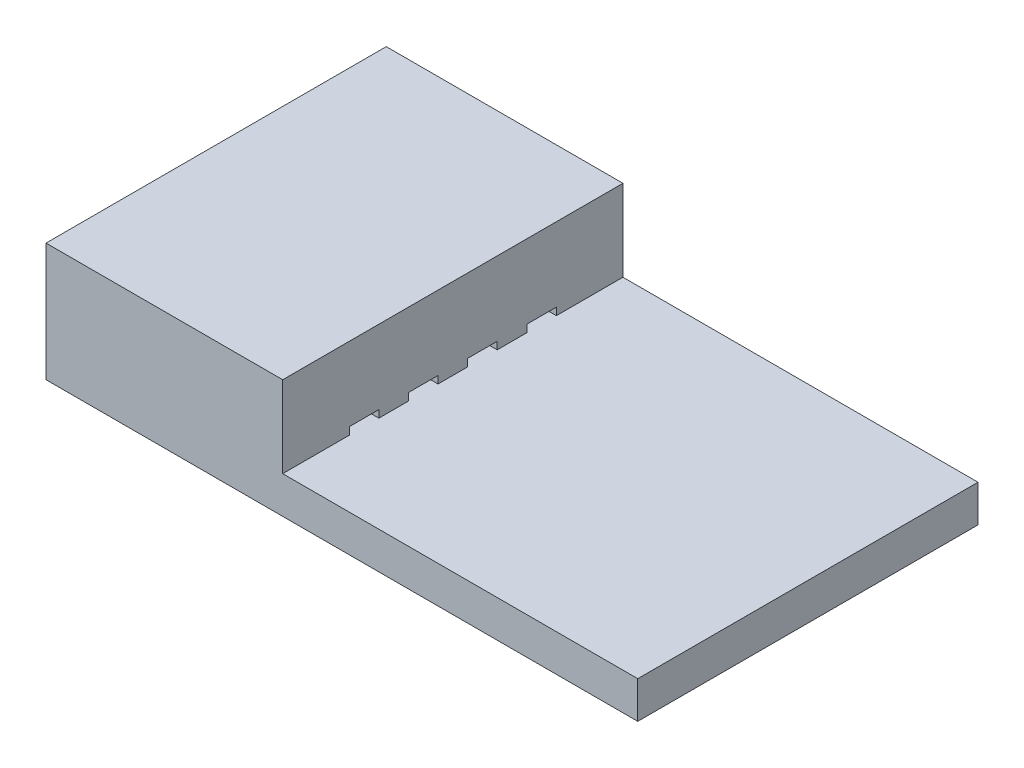
ISO-10303-21;
HEADER;
FILE_DESCRIPTION(('STEP AP214'),'2;1');
FILE_NAME('part.step','',(''),(''),'','','');
FILE_SCHEMA(('AUTOMOTIVE_DESIGN { 1 0 10303 214 1 1 1 1 }'));
ENDSEC;
DATA;
#1=APPLICATION_CONTEXT('core data for automotive mechanical design processes');
#2=APPLICATION_PROTOCOL_DEFINITION('international standard','automotive_design',2000,#1);
#3=PRODUCT_CONTEXT('',#1,'mechanical');
#4=PRODUCT('Part','Part','',(#3));
#5=PRODUCT_RELATED_PRODUCT_CATEGORY('part','',(#4));
#6=PRODUCT_DEFINITION_FORMATION('','',#4);
#7=PRODUCT_DEFINITION_CONTEXT('part definition',#1,'design');
#8=PRODUCT_DEFINITION('design','',#6,#7);
#9=PRODUCT_DEFINITION_SHAPE('','',#8);
#10=(LENGTH_UNIT() NAMED_UNIT(*) SI_UNIT(.MILLI.,.METRE.));
#11=(NAMED_UNIT(*) PLANE_ANGLE_UNIT() SI_UNIT($,.RADIAN.));
#12=(NAMED_UNIT(*) SI_UNIT($,.STERADIAN.) SOLID_ANGLE_UNIT());
#13=UNCERTAINTY_MEASURE_WITH_UNIT(LENGTH_MEASURE(1.E-05),#10,'distance_accuracy_value','');
#14=(GEOMETRIC_REPRESENTATION_CONTEXT(3) GLOBAL_UNCERTAINTY_ASSIGNED_CONTEXT((#13)) GLOBAL_UNIT_ASSIGNED_CONTEXT((#10,
#11,#12)) REPRESENTATION_CONTEXT('',''));
#15=CARTESIAN_POINT('',(0.,0.,0.));
#16=DIRECTION('',(0.,0.,1.));
#17=DIRECTION('',(1.,0.,0.));
#18=AXIS2_PLACEMENT_3D('',#15,#16,#17);
#19=CARTESIAN_POINT('',(-20.,2.,-5.75));
#20=DIRECTION('',(0.,0.,-1.));
#21=DIRECTION('',(-1.,0.,0.));
#22=AXIS2_PLACEMENT_3D('',#19,#20,#21);
#23=PLANE('',#22);
#24=DIRECTION('',(-1.,0.,0.));
#25=VECTOR('',#24,1.);
#26=CARTESIAN_POINT('',(0.,-0.750000000000001,-5.75));
#27=LINE('',#26,#25);
#28=CARTESIAN_POINT('',(0.,-0.750000000000001,-5.75));
#29=VERTEX_POINT('',#28);
#30=CARTESIAN_POINT('',(-12.,-0.750000000000001,-5.75));
#31=VERTEX_POINT('',#30);
#32=EDGE_CURVE('E317',#29,#31,#27,.T.);
#33=ORIENTED_EDGE('',*,*,#32,.F.);
#34=DIRECTION('',(0.,1.,0.));
#35=VECTOR('',#34,1.);
#36=CARTESIAN_POINT('',(0.,2.,-5.75));
#37=LINE('',#36,#35);
#38=CARTESIAN_POINT('',(0.,-2.,-5.75));
#39=VERTEX_POINT('',#38);
#40=EDGE_CURVE('E323',#39,#29,#37,.T.);
#41=ORIENTED_EDGE('',*,*,#40,.F.);
#42=DIRECTION('',(1.,0.,0.));
#43=VECTOR('',#42,1.);
#44=CARTESIAN_POINT('',(-20.,-2.,-5.75));
#45=LINE('',#44,#43);
#46=CARTESIAN_POINT('',(-20.,-2.,-5.75));
#47=VERTEX_POINT('',#46);
#48=EDGE_CURVE('E12',#47,#39,#45,.T.);
#49=ORIENTED_EDGE('',*,*,#48,.F.);
#50=DIRECTION('',(0.,1.,0.));
#51=VECTOR('',#50,1.);
#52=CARTESIAN_POINT('',(-20.,2.,-5.75));
#53=LINE('',#52,#51);
#54=CARTESIAN_POINT('',(-20.,2.,-5.75));
#55=VERTEX_POINT('',#54);
#56=EDGE_CURVE('E334',#47,#55,#53,.T.);
#57=ORIENTED_EDGE('',*,*,#56,.T.);
#58=DIRECTION('',(1.,0.,0.));
#59=VECTOR('',#58,1.);
#60=CARTESIAN_POINT('',(-20.,2.,-5.75));
#61=LINE('',#60,#59);
#62=CARTESIAN_POINT('',(-12.,2.,-5.75));
#63=VERTEX_POINT('',#62);
#64=EDGE_CURVE('E45',#55,#63,#61,.T.);
#65=ORIENTED_EDGE('',*,*,#64,.T.);
#66=DIRECTION('',(0.,1.,0.));
#67=VECTOR('',#66,1.);
#68=CARTESIAN_POINT('',(-12.,-18.6207701385947,-5.75));
#69=LINE('',#68,#67);
#70=EDGE_CURVE('E320',#31,#63,#69,.T.);
#71=ORIENTED_EDGE('',*,*,#70,.F.);
#72=EDGE_LOOP('',(#33,#41,#49,#57,#65,#71));
#73=FACE_BOUND('',#72,.T.);
#74=ADVANCED_FACE('F42',(#73),#23,.T.);
#75=CARTESIAN_POINT('',(-20.,-2.,5.75));
#76=DIRECTION('',(0.,-1.,0.));
#77=DIRECTION('',(0.,0.,-1.));
#78=AXIS2_PLACEMENT_3D('',#75,#76,#77);
#79=PLANE('',#78);
#80=DIRECTION('',(0.,0.,-1.));
#81=VECTOR('',#80,1.);
#82=CARTESIAN_POINT('',(0.,-2.,5.75));
#83=LINE('',#82,#81);
#84=CARTESIAN_POINT('',(0.,-2.,5.75));
#85=VERTEX_POINT('',#84);
#86=EDGE_CURVE('E338',#85,#39,#83,.T.);
#87=ORIENTED_EDGE('',*,*,#86,.F.);
#88=DIRECTION('',(1.,0.,0.));
#89=VECTOR('',#88,1.);
#90=CARTESIAN_POINT('',(-20.,-2.,5.75));
#91=LINE('',#90,#89);
#92=CARTESIAN_POINT('',(-20.,-2.,5.75));
#93=VERTEX_POINT('',#92);
#94=EDGE_CURVE('E50',#93,#85,#91,.T.);
#95=ORIENTED_EDGE('',*,*,#94,.F.);
#96=DIRECTION('',(0.,0.,-1.));
#97=VECTOR('',#96,1.);
#98=CARTESIAN_POINT('',(-20.,-2.,5.75));
#99=LINE('',#98,#97);
#100=EDGE_CURVE('E344',#93,#47,#99,.T.);
#101=ORIENTED_EDGE('',*,*,#100,.T.);
#102=ORIENTED_EDGE('',*,*,#48,.T.);
#103=EDGE_LOOP('',(#87,#95,#101,#102));
#104=FACE_BOUND('',#103,.T.);
#105=ADVANCED_FACE('F385',(#104),#79,.T.);
#106=CARTESIAN_POINT('',(-20.,2.,5.75));
#107=DIRECTION('',(0.,0.,1.));
#108=DIRECTION('',(1.,0.,0.));
#109=AXIS2_PLACEMENT_3D('',#106,#107,#108);
#110=PLANE('',#109);
#111=DIRECTION('',(1.,0.,0.));
#112=VECTOR('',#111,1.);
#113=CARTESIAN_POINT('',(0.,-0.750000000000001,5.75));
#114=LINE('',#113,#112);
#115=CARTESIAN_POINT('',(-12.,-0.750000000000001,5.75));
#116=VERTEX_POINT('',#115);
#117=CARTESIAN_POINT('',(0.,-0.750000000000001,5.75));
#118=VERTEX_POINT('',#117);
#119=EDGE_CURVE('E324',#116,#118,#114,.T.);
#120=ORIENTED_EDGE('',*,*,#119,.F.);
#121=DIRECTION('',(0.,1.,0.));
#122=VECTOR('',#121,1.);
#123=CARTESIAN_POINT('',(-12.,-18.6207701385947,5.75));
#124=LINE('',#123,#122);
#125=CARTESIAN_POINT('',(-12.,2.,5.75));
#126=VERTEX_POINT('',#125);
#127=EDGE_CURVE('E326',#116,#126,#124,.T.);
#128=ORIENTED_EDGE('',*,*,#127,.T.);
#129=DIRECTION('',(1.,0.,0.));
#130=VECTOR('',#129,1.);
#131=CARTESIAN_POINT('',(-20.,2.,5.75));
#132=LINE('',#131,#130);
#133=CARTESIAN_POINT('',(-20.,2.,5.75));
#134=VERTEX_POINT('',#133);
#135=EDGE_CURVE('E354',#134,#126,#132,.T.);
#136=ORIENTED_EDGE('',*,*,#135,.F.);
#137=DIRECTION('',(0.,-1.,0.));
#138=VECTOR('',#137,1.);
#139=CARTESIAN_POINT('',(-20.,2.,5.75));
#140=LINE('',#139,#138);
#141=EDGE_CURVE('E341',#134,#93,#140,.T.);
#142=ORIENTED_EDGE('',*,*,#141,.T.);
#143=ORIENTED_EDGE('',*,*,#94,.T.);
#144=DIRECTION('',(0.,-1.,0.));
#145=VECTOR('',#144,1.);
#146=CARTESIAN_POINT('',(0.,2.,5.75));
#147=LINE('',#146,#145);
#148=EDGE_CURVE('E349',#118,#85,#147,.T.);
#149=ORIENTED_EDGE('',*,*,#148,.F.);
#150=EDGE_LOOP('',(#120,#128,#136,#142,#143,#149));
#151=FACE_BOUND('',#150,.T.);
#152=ADVANCED_FACE('F370',(#151),#110,.T.);
#153=CARTESIAN_POINT('',(-20.,2.,5.75));
#154=DIRECTION('',(0.,1.,0.));
#155=DIRECTION('',(0.,0.,1.));
#156=AXIS2_PLACEMENT_3D('',#153,#154,#155);
#157=PLANE('',#156);
#158=DIRECTION('',(0.,0.,1.));
#159=VECTOR('',#158,1.);
#160=CARTESIAN_POINT('',(-12.,2.,5.75));
#161=LINE('',#160,#159);
#162=EDGE_CURVE('E308',#63,#126,#161,.T.);
#163=ORIENTED_EDGE('',*,*,#162,.F.);
#164=ORIENTED_EDGE('',*,*,#64,.F.);
#165=DIRECTION('',(0.,0.,1.));
#166=VECTOR('',#165,1.);
#167=CARTESIAN_POINT('',(-20.,2.,5.75));
#168=LINE('',#167,#166);
#169=EDGE_CURVE('E337',#55,#134,#168,.T.);
#170=ORIENTED_EDGE('',*,*,#169,.T.);
#171=ORIENTED_EDGE('',*,*,#135,.T.);
#172=EDGE_LOOP('',(#163,#164,#170,#171));
#173=FACE_BOUND('',#172,.T.);
#174=ADVANCED_FACE('F364',(#173),#157,.T.);
#175=CARTESIAN_POINT('',(-20.,-2.,-5.75));
#176=DIRECTION('',(1.,0.,0.));
#177=DIRECTION('',(0.,0.,-1.));
#178=AXIS2_PLACEMENT_3D('',#175,#176,#177);
#179=PLANE('',#178);
#180=DIRECTION('',(0.,0.,1.));
#181=VECTOR('',#180,1.);
#182=CARTESIAN_POINT('',(-20.,-0.500000000000001,-2.5));
#183=LINE('',#182,#181);
#184=CARTESIAN_POINT('',(-20.,-0.500000000000001,-3.5));
#185=VERTEX_POINT('',#184);
#186=CARTESIAN_POINT('',(-20.,-0.500000000000001,-2.5));
#187=VERTEX_POINT('',#186);
#188=EDGE_CURVE('E198',#185,#187,#183,.T.);
#189=ORIENTED_EDGE('',*,*,#188,.T.);
#190=DIRECTION('',(0.,-1.,0.));
#191=VECTOR('',#190,1.);
#192=CARTESIAN_POINT('',(-20.,-0.750000000000001,-2.5));
#193=LINE('',#192,#191);
#194=CARTESIAN_POINT('',(-20.,-0.750000000000001,-2.5));
#195=VERTEX_POINT('',#194);
#196=EDGE_CURVE('E193',#187,#195,#193,.T.);
#197=ORIENTED_EDGE('',*,*,#196,.T.);
#198=DIRECTION('',(0.,0.,-1.));
#199=VECTOR('',#198,1.);
#200=CARTESIAN_POINT('',(-20.,-0.750000000000001,-2.5));
#201=LINE('',#200,#199);
#202=CARTESIAN_POINT('',(-20.,-0.750000000000001,-3.5));
#203=VERTEX_POINT('',#202);
#204=EDGE_CURVE('E201',#195,#203,#201,.T.);
#205=ORIENTED_EDGE('',*,*,#204,.T.);
#206=DIRECTION('',(0.,1.,0.));
#207=VECTOR('',#206,1.);
#208=CARTESIAN_POINT('',(-20.,-0.750000000000001,-3.5));
#209=LINE('',#208,#207);
#210=EDGE_CURVE('E58',#203,#185,#209,.T.);
#211=ORIENTED_EDGE('',*,*,#210,.T.);
#212=EDGE_LOOP('',(#189,#197,#205,#211));
#213=FACE_BOUND('',#212,.T.);
#214=DIRECTION('',(0.,0.,1.));
#215=VECTOR('',#214,1.);
#216=CARTESIAN_POINT('',(-20.,-0.500000000000001,-0.5));
#217=LINE('',#216,#215);
#218=CARTESIAN_POINT('',(-20.,-0.500000000000001,-1.5));
#219=VERTEX_POINT('',#218);
#220=CARTESIAN_POINT('',(-20.,-0.500000000000001,-0.5));
#221=VERTEX_POINT('',#220);
#222=EDGE_CURVE('E236',#219,#221,#217,.T.);
#223=ORIENTED_EDGE('',*,*,#222,.T.);
#224=DIRECTION('',(0.,-1.,0.));
#225=VECTOR('',#224,1.);
#226=CARTESIAN_POINT('',(-20.,-0.750000000000001,-0.5));
#227=LINE('',#226,#225);
#228=CARTESIAN_POINT('',(-20.,-0.750000000000001,-0.5));
#229=VERTEX_POINT('',#228);
#230=EDGE_CURVE('E226',#221,#229,#227,.T.);
#231=ORIENTED_EDGE('',*,*,#230,.T.);
#232=DIRECTION('',(0.,0.,-1.));
#233=VECTOR('',#232,1.);
#234=CARTESIAN_POINT('',(-20.,-0.750000000000001,-0.5));
#235=LINE('',#234,#233);
#236=CARTESIAN_POINT('',(-20.,-0.750000000000001,-1.5));
#237=VERTEX_POINT('',#236);
#238=EDGE_CURVE('E229',#229,#237,#235,.T.);
#239=ORIENTED_EDGE('',*,*,#238,.T.);
#240=DIRECTION('',(0.,1.,0.));
#241=VECTOR('',#240,1.);
#242=CARTESIAN_POINT('',(-20.,-0.750000000000001,-1.5));
#243=LINE('',#242,#241);
#244=EDGE_CURVE('E233',#237,#219,#243,.T.);
#245=ORIENTED_EDGE('',*,*,#244,.T.);
#246=EDGE_LOOP('',(#223,#231,#239,#245));
#247=FACE_BOUND('',#246,.T.);
#248=DIRECTION('',(0.,0.,1.));
#249=VECTOR('',#248,1.);
#250=CARTESIAN_POINT('',(-20.,-0.5,1.5));
#251=LINE('',#250,#249);
#252=CARTESIAN_POINT('',(-20.,-0.5,0.5));
#253=VERTEX_POINT('',#252);
#254=CARTESIAN_POINT('',(-20.,-0.5,1.5));
#255=VERTEX_POINT('',#254);
#256=EDGE_CURVE('E266',#253,#255,#251,.T.);
#257=ORIENTED_EDGE('',*,*,#256,.T.);
#258=DIRECTION('',(0.,-1.,0.));
#259=VECTOR('',#258,1.);
#260=CARTESIAN_POINT('',(-20.,-0.75,1.5));
#261=LINE('',#260,#259);
#262=CARTESIAN_POINT('',(-20.,-0.75,1.5));
#263=VERTEX_POINT('',#262);
#264=EDGE_CURVE('E256',#255,#263,#261,.T.);
#265=ORIENTED_EDGE('',*,*,#264,.T.);
#266=DIRECTION('',(0.,0.,-1.));
#267=VECTOR('',#266,1.);
#268=CARTESIAN_POINT('',(-20.,-0.75,1.5));
#269=LINE('',#268,#267);
#270=CARTESIAN_POINT('',(-20.,-0.75,0.5));
#271=VERTEX_POINT('',#270);
#272=EDGE_CURVE('E259',#263,#271,#269,.T.);
#273=ORIENTED_EDGE('',*,*,#272,.T.);
#274=DIRECTION('',(0.,1.,0.));
#275=VECTOR('',#274,1.);
#276=CARTESIAN_POINT('',(-20.,-0.75,0.5));
#277=LINE('',#276,#275);
#278=EDGE_CURVE('E263',#271,#253,#277,.T.);
#279=ORIENTED_EDGE('',*,*,#278,.T.);
#280=EDGE_LOOP('',(#257,#265,#273,#279));
#281=FACE_BOUND('',#280,.T.);
#282=DIRECTION('',(0.,0.,1.));
#283=VECTOR('',#282,1.);
#284=CARTESIAN_POINT('',(-20.,-0.5,3.5));
#285=LINE('',#284,#283);
#286=CARTESIAN_POINT('',(-20.,-0.5,2.5));
#287=VERTEX_POINT('',#286);
#288=CARTESIAN_POINT('',(-20.,-0.5,3.5));
#289=VERTEX_POINT('',#288);
#290=EDGE_CURVE('E296',#287,#289,#285,.T.);
#291=ORIENTED_EDGE('',*,*,#290,.T.);
#292=DIRECTION('',(0.,-1.,0.));
#293=VECTOR('',#292,1.);
#294=CARTESIAN_POINT('',(-20.,-0.75,3.5));
#295=LINE('',#294,#293);
#296=CARTESIAN_POINT('',(-20.,-0.75,3.5));
#297=VERTEX_POINT('',#296);
#298=EDGE_CURVE('E286',#289,#297,#295,.T.);
#299=ORIENTED_EDGE('',*,*,#298,.T.);
#300=DIRECTION('',(0.,0.,-1.));
#301=VECTOR('',#300,1.);
#302=CARTESIAN_POINT('',(-20.,-0.75,3.5));
#303=LINE('',#302,#301);
#304=CARTESIAN_POINT('',(-20.,-0.75,2.5));
#305=VERTEX_POINT('',#304);
#306=EDGE_CURVE('E289',#297,#305,#303,.T.);
#307=ORIENTED_EDGE('',*,*,#306,.T.);
#308=DIRECTION('',(0.,1.,0.));
#309=VECTOR('',#308,1.);
#310=CARTESIAN_POINT('',(-20.,-0.75,2.5));
#311=LINE('',#310,#309);
#312=EDGE_CURVE('E293',#305,#287,#311,.T.);
#313=ORIENTED_EDGE('',*,*,#312,.T.);
#314=EDGE_LOOP('',(#291,#299,#307,#313));
#315=FACE_BOUND('',#314,.T.);
#316=ORIENTED_EDGE('',*,*,#56,.F.);
#317=ORIENTED_EDGE('',*,*,#100,.F.);
#318=ORIENTED_EDGE('',*,*,#141,.F.);
#319=ORIENTED_EDGE('',*,*,#169,.F.);
#320=EDGE_LOOP('',(#316,#317,#318,#319));
#321=FACE_BOUND('',#320,.T.);
#322=ADVANCED_FACE('F206',(#213,#247,#281,#315,#321),#179,.F.);
#323=CARTESIAN_POINT('',(0.,-2.,-5.75));
#324=DIRECTION('',(1.,0.,0.));
#325=DIRECTION('',(0.,0.,-1.));
#326=AXIS2_PLACEMENT_3D('',#323,#324,#325);
#327=PLANE('',#326);
#328=DIRECTION('',(0.,0.,-1.));
#329=VECTOR('',#328,1.);
#330=CARTESIAN_POINT('',(0.,-0.750000000000001,5.75));
#331=LINE('',#330,#329);
#332=EDGE_CURVE('E321',#118,#29,#331,.T.);
#333=ORIENTED_EDGE('',*,*,#332,.F.);
#334=ORIENTED_EDGE('',*,*,#148,.T.);
#335=ORIENTED_EDGE('',*,*,#86,.T.);
#336=ORIENTED_EDGE('',*,*,#40,.T.);
#337=EDGE_LOOP('',(#333,#334,#335,#336));
#338=FACE_BOUND('',#337,.T.);
#339=ADVANCED_FACE('F383',(#338),#327,.T.);
#340=CARTESIAN_POINT('',(-20.,-0.75,5.75));
#341=DIRECTION('',(0.,-1.,0.));
#342=DIRECTION('',(0.,0.,-1.));
#343=AXIS2_PLACEMENT_3D('',#340,#341,#342);
#344=PLANE('',#343);
#345=ORIENTED_EDGE('',*,*,#332,.T.);
#346=ORIENTED_EDGE('',*,*,#32,.T.);
#347=DIRECTION('',(0.,0.,1.));
#348=VECTOR('',#347,1.);
#349=CARTESIAN_POINT('',(-12.,-0.750000000000001,5.75));
#350=LINE('',#349,#348);
#351=CARTESIAN_POINT('',(-12.,-0.750000000000001,-3.5));
#352=VERTEX_POINT('',#351);
#353=EDGE_CURVE('E327',#31,#352,#350,.T.);
#354=ORIENTED_EDGE('',*,*,#353,.T.);
#355=DIRECTION('',(1.,0.,0.));
#356=VECTOR('',#355,1.);
#357=CARTESIAN_POINT('',(-20.,-0.750000000000001,-3.5));
#358=LINE('',#357,#356);
#359=EDGE_CURVE('E197',#203,#352,#358,.T.);
#360=ORIENTED_EDGE('',*,*,#359,.F.);
#361=ORIENTED_EDGE('',*,*,#204,.F.);
#362=DIRECTION('',(1.,0.,0.));
#363=VECTOR('',#362,1.);
#364=CARTESIAN_POINT('',(-20.,-0.750000000000001,-2.5));
#365=LINE('',#364,#363);
#366=CARTESIAN_POINT('',(-12.,-0.750000000000001,-2.5));
#367=VERTEX_POINT('',#366);
#368=EDGE_CURVE('E189',#195,#367,#365,.T.);
#369=ORIENTED_EDGE('',*,*,#368,.T.);
#370=CARTESIAN_POINT('',(-12.,-0.750000000000001,-1.5));
#371=VERTEX_POINT('',#370);
#372=EDGE_CURVE('E329',#367,#371,#350,.T.);
#373=ORIENTED_EDGE('',*,*,#372,.T.);
#374=DIRECTION('',(1.,0.,0.));
#375=VECTOR('',#374,1.);
#376=CARTESIAN_POINT('',(-20.,-0.750000000000001,-1.5));
#377=LINE('',#376,#375);
#378=EDGE_CURVE('E251',#237,#371,#377,.T.);
#379=ORIENTED_EDGE('',*,*,#378,.F.);
#380=ORIENTED_EDGE('',*,*,#238,.F.);
#381=DIRECTION('',(1.,0.,0.));
#382=VECTOR('',#381,1.);
#383=CARTESIAN_POINT('',(-20.,-0.750000000000001,-0.5));
#384=LINE('',#383,#382);
#385=CARTESIAN_POINT('',(-12.,-0.750000000000001,-0.5));
#386=VERTEX_POINT('',#385);
#387=EDGE_CURVE('E239',#229,#386,#384,.T.);
#388=ORIENTED_EDGE('',*,*,#387,.T.);
#389=CARTESIAN_POINT('',(-12.,-0.75,0.5));
#390=VERTEX_POINT('',#389);
#391=EDGE_CURVE('E456',#386,#390,#350,.T.);
#392=ORIENTED_EDGE('',*,*,#391,.T.);
#393=DIRECTION('',(1.,0.,0.));
#394=VECTOR('',#393,1.);
#395=CARTESIAN_POINT('',(-20.,-0.75,0.5));
#396=LINE('',#395,#394);
#397=EDGE_CURVE('E281',#271,#390,#396,.T.);
#398=ORIENTED_EDGE('',*,*,#397,.F.);
#399=ORIENTED_EDGE('',*,*,#272,.F.);
#400=DIRECTION('',(1.,0.,0.));
#401=VECTOR('',#400,1.);
#402=CARTESIAN_POINT('',(-20.,-0.75,1.5));
#403=LINE('',#402,#401);
#404=CARTESIAN_POINT('',(-12.,-0.750000000000001,1.5));
#405=VERTEX_POINT('',#404);
#406=EDGE_CURVE('E269',#263,#405,#403,.T.);
#407=ORIENTED_EDGE('',*,*,#406,.T.);
#408=CARTESIAN_POINT('',(-12.,-0.75,2.5));
#409=VERTEX_POINT('',#408);
#410=EDGE_CURVE('E457',#405,#409,#350,.T.);
#411=ORIENTED_EDGE('',*,*,#410,.T.);
#412=DIRECTION('',(1.,0.,0.));
#413=VECTOR('',#412,1.);
#414=CARTESIAN_POINT('',(-20.,-0.75,2.5));
#415=LINE('',#414,#413);
#416=EDGE_CURVE('E311',#305,#409,#415,.T.);
#417=ORIENTED_EDGE('',*,*,#416,.F.);
#418=ORIENTED_EDGE('',*,*,#306,.F.);
#419=DIRECTION('',(1.,0.,0.));
#420=VECTOR('',#419,1.);
#421=CARTESIAN_POINT('',(-20.,-0.75,3.5));
#422=LINE('',#421,#420);
#423=CARTESIAN_POINT('',(-12.,-0.750000000000001,3.5));
#424=VERTEX_POINT('',#423);
#425=EDGE_CURVE('E299',#297,#424,#422,.T.);
#426=ORIENTED_EDGE('',*,*,#425,.T.);
#427=EDGE_CURVE('E330',#424,#116,#350,.T.);
#428=ORIENTED_EDGE('',*,*,#427,.T.);
#429=ORIENTED_EDGE('',*,*,#119,.T.);
#430=EDGE_LOOP('',(#345,#346,#354,#360,#361,#369,#373,#379,#380,#388,#392,#398,#399,#407,#411,
#417,#418,#426,#428,#429));
#431=FACE_BOUND('',#430,.T.);
#432=ADVANCED_FACE('F202',(#431),#344,.F.);
#433=CARTESIAN_POINT('',(-12.,-18.6207701385947,5.75));
#434=DIRECTION('',(-1.,0.,0.));
#435=DIRECTION('',(0.,0.,1.));
#436=AXIS2_PLACEMENT_3D('',#433,#434,#435);
#437=PLANE('',#436);
#438=ORIENTED_EDGE('',*,*,#372,.F.);
#439=DIRECTION('',(0.,-1.,0.));
#440=VECTOR('',#439,1.);
#441=CARTESIAN_POINT('',(-12.,-0.750000000000001,-2.5));
#442=LINE('',#441,#440);
#443=CARTESIAN_POINT('',(-12.,-0.500000000000001,-2.5));
#444=VERTEX_POINT('',#443);
#445=EDGE_CURVE('E66',#444,#367,#442,.T.);
#446=ORIENTED_EDGE('',*,*,#445,.F.);
#447=DIRECTION('',(0.,0.,1.));
#448=VECTOR('',#447,1.);
#449=CARTESIAN_POINT('',(-12.,-0.500000000000001,-2.5));
#450=LINE('',#449,#448);
#451=CARTESIAN_POINT('',(-12.,-0.500000000000001,-3.5));
#452=VERTEX_POINT('',#451);
#453=EDGE_CURVE('E209',#452,#444,#450,.T.);
#454=ORIENTED_EDGE('',*,*,#453,.F.);
#455=DIRECTION('',(0.,1.,0.));
#456=VECTOR('',#455,1.);
#457=CARTESIAN_POINT('',(-12.,-0.750000000000001,-3.5));
#458=LINE('',#457,#456);
#459=EDGE_CURVE('E212',#352,#452,#458,.T.);
#460=ORIENTED_EDGE('',*,*,#459,.F.);
#461=ORIENTED_EDGE('',*,*,#353,.F.);
#462=ORIENTED_EDGE('',*,*,#70,.T.);
#463=ORIENTED_EDGE('',*,*,#162,.T.);
#464=ORIENTED_EDGE('',*,*,#127,.F.);
#465=ORIENTED_EDGE('',*,*,#427,.F.);
#466=DIRECTION('',(0.,-1.,0.));
#467=VECTOR('',#466,1.);
#468=CARTESIAN_POINT('',(-12.,-0.75,3.5));
#469=LINE('',#468,#467);
#470=CARTESIAN_POINT('',(-12.,-0.5,3.5));
#471=VERTEX_POINT('',#470);
#472=EDGE_CURVE('E278',#471,#424,#469,.T.);
#473=ORIENTED_EDGE('',*,*,#472,.F.);
#474=DIRECTION('',(0.,0.,1.));
#475=VECTOR('',#474,1.);
#476=CARTESIAN_POINT('',(-12.,-0.5,3.5));
#477=LINE('',#476,#475);
#478=CARTESIAN_POINT('',(-12.,-0.5,2.5));
#479=VERTEX_POINT('',#478);
#480=EDGE_CURVE('E290',#479,#471,#477,.T.);
#481=ORIENTED_EDGE('',*,*,#480,.F.);
#482=DIRECTION('',(0.,1.,0.));
#483=VECTOR('',#482,1.);
#484=CARTESIAN_POINT('',(-12.,-0.75,2.5));
#485=LINE('',#484,#483);
#486=EDGE_CURVE('E301',#409,#479,#485,.T.);
#487=ORIENTED_EDGE('',*,*,#486,.F.);
#488=ORIENTED_EDGE('',*,*,#410,.F.);
#489=DIRECTION('',(0.,-1.,0.));
#490=VECTOR('',#489,1.);
#491=CARTESIAN_POINT('',(-12.,-0.75,1.5));
#492=LINE('',#491,#490);
#493=CARTESIAN_POINT('',(-12.,-0.5,1.5));
#494=VERTEX_POINT('',#493);
#495=EDGE_CURVE('E248',#494,#405,#492,.T.);
#496=ORIENTED_EDGE('',*,*,#495,.F.);
#497=DIRECTION('',(0.,0.,1.));
#498=VECTOR('',#497,1.);
#499=CARTESIAN_POINT('',(-12.,-0.5,1.5));
#500=LINE('',#499,#498);
#501=CARTESIAN_POINT('',(-12.,-0.5,0.5));
#502=VERTEX_POINT('',#501);
#503=EDGE_CURVE('E260',#502,#494,#500,.T.);
#504=ORIENTED_EDGE('',*,*,#503,.F.);
#505=DIRECTION('',(0.,1.,0.));
#506=VECTOR('',#505,1.);
#507=CARTESIAN_POINT('',(-12.,-0.75,0.5));
#508=LINE('',#507,#506);
#509=EDGE_CURVE('E271',#390,#502,#508,.T.);
#510=ORIENTED_EDGE('',*,*,#509,.F.);
#511=ORIENTED_EDGE('',*,*,#391,.F.);
#512=DIRECTION('',(0.,-1.,0.));
#513=VECTOR('',#512,1.);
#514=CARTESIAN_POINT('',(-12.,-0.750000000000001,-0.5));
#515=LINE('',#514,#513);
#516=CARTESIAN_POINT('',(-12.,-0.500000000000001,-0.5));
#517=VERTEX_POINT('',#516);
#518=EDGE_CURVE('E222',#517,#386,#515,.T.);
#519=ORIENTED_EDGE('',*,*,#518,.F.);
#520=DIRECTION('',(0.,0.,1.));
#521=VECTOR('',#520,1.);
#522=CARTESIAN_POINT('',(-12.,-0.500000000000001,-0.5));
#523=LINE('',#522,#521);
#524=CARTESIAN_POINT('',(-12.,-0.500000000000001,-1.5));
#525=VERTEX_POINT('',#524);
#526=EDGE_CURVE('E230',#525,#517,#523,.T.);
#527=ORIENTED_EDGE('',*,*,#526,.F.);
#528=DIRECTION('',(0.,1.,0.));
#529=VECTOR('',#528,1.);
#530=CARTESIAN_POINT('',(-12.,-0.750000000000001,-1.5));
#531=LINE('',#530,#529);
#532=EDGE_CURVE('E241',#371,#525,#531,.T.);
#533=ORIENTED_EDGE('',*,*,#532,.F.);
#534=EDGE_LOOP('',(#438,#446,#454,#460,#461,#462,#463,#464,#465,#473,#481,#487,#488,#496,#504,
#510,#511,#519,#527,#533));
#535=FACE_BOUND('',#534,.T.);
#536=ADVANCED_FACE('F376',(#535),#437,.F.);
#537=CARTESIAN_POINT('',(-20.,-0.75,3.5));
#538=DIRECTION('',(0.,0.,1.));
#539=DIRECTION('',(0.,-1.,0.));
#540=AXIS2_PLACEMENT_3D('',#537,#538,#539);
#541=PLANE('',#540);
#542=ORIENTED_EDGE('',*,*,#472,.T.);
#543=ORIENTED_EDGE('',*,*,#425,.F.);
#544=ORIENTED_EDGE('',*,*,#298,.F.);
#545=DIRECTION('',(1.,0.,0.));
#546=VECTOR('',#545,1.);
#547=CARTESIAN_POINT('',(-20.,-0.5,3.5));
#548=LINE('',#547,#546);
#549=EDGE_CURVE('E306',#289,#471,#548,.T.);
#550=ORIENTED_EDGE('',*,*,#549,.T.);
#551=EDGE_LOOP('',(#542,#543,#544,#550));
#552=FACE_BOUND('',#551,.T.);
#553=ADVANCED_FACE('F407',(#552),#541,.F.);
#554=CARTESIAN_POINT('',(-20.,-0.5,3.5));
#555=DIRECTION('',(0.,1.,0.));
#556=DIRECTION('',(0.,0.,1.));
#557=AXIS2_PLACEMENT_3D('',#554,#555,#556);
#558=PLANE('',#557);
#559=ORIENTED_EDGE('',*,*,#480,.T.);
#560=ORIENTED_EDGE('',*,*,#549,.F.);
#561=ORIENTED_EDGE('',*,*,#290,.F.);
#562=DIRECTION('',(1.,0.,0.));
#563=VECTOR('',#562,1.);
#564=CARTESIAN_POINT('',(-20.,-0.5,2.5));
#565=LINE('',#564,#563);
#566=EDGE_CURVE('E309',#287,#479,#565,.T.);
#567=ORIENTED_EDGE('',*,*,#566,.T.);
#568=EDGE_LOOP('',(#559,#560,#561,#567));
#569=FACE_BOUND('',#568,.T.);
#570=ADVANCED_FACE('F410',(#569),#558,.F.);
#571=CARTESIAN_POINT('',(-20.,-0.75,2.5));
#572=DIRECTION('',(0.,0.,-1.));
#573=DIRECTION('',(0.,1.,0.));
#574=AXIS2_PLACEMENT_3D('',#571,#572,#573);
#575=PLANE('',#574);
#576=ORIENTED_EDGE('',*,*,#486,.T.);
#577=ORIENTED_EDGE('',*,*,#566,.F.);
#578=ORIENTED_EDGE('',*,*,#312,.F.);
#579=ORIENTED_EDGE('',*,*,#416,.T.);
#580=EDGE_LOOP('',(#576,#577,#578,#579));
#581=FACE_BOUND('',#580,.T.);
#582=ADVANCED_FACE('F412',(#581),#575,.F.);
#583=CARTESIAN_POINT('',(-20.,-0.75,1.5));
#584=DIRECTION('',(0.,0.,1.));
#585=DIRECTION('',(0.,-1.,0.));
#586=AXIS2_PLACEMENT_3D('',#583,#584,#585);
#587=PLANE('',#586);
#588=ORIENTED_EDGE('',*,*,#495,.T.);
#589=ORIENTED_EDGE('',*,*,#406,.F.);
#590=ORIENTED_EDGE('',*,*,#264,.F.);
#591=DIRECTION('',(1.,0.,0.));
#592=VECTOR('',#591,1.);
#593=CARTESIAN_POINT('',(-20.,-0.5,1.5));
#594=LINE('',#593,#592);
#595=EDGE_CURVE('E276',#255,#494,#594,.T.);
#596=ORIENTED_EDGE('',*,*,#595,.T.);
#597=EDGE_LOOP('',(#588,#589,#590,#596));
#598=FACE_BOUND('',#597,.T.);
#599=ADVANCED_FACE('F415',(#598),#587,.F.);
#600=CARTESIAN_POINT('',(-20.,-0.5,1.5));
#601=DIRECTION('',(0.,1.,0.));
#602=DIRECTION('',(0.,0.,1.));
#603=AXIS2_PLACEMENT_3D('',#600,#601,#602);
#604=PLANE('',#603);
#605=ORIENTED_EDGE('',*,*,#503,.T.);
#606=ORIENTED_EDGE('',*,*,#595,.F.);
#607=ORIENTED_EDGE('',*,*,#256,.F.);
#608=DIRECTION('',(1.,0.,0.));
#609=VECTOR('',#608,1.);
#610=CARTESIAN_POINT('',(-20.,-0.5,0.5));
#611=LINE('',#610,#609);
#612=EDGE_CURVE('E279',#253,#502,#611,.T.);
#613=ORIENTED_EDGE('',*,*,#612,.T.);
#614=EDGE_LOOP('',(#605,#606,#607,#613));
#615=FACE_BOUND('',#614,.T.);
#616=ADVANCED_FACE('F422',(#615),#604,.F.);
#617=CARTESIAN_POINT('',(-20.,-0.75,0.5));
#618=DIRECTION('',(0.,0.,-1.));
#619=DIRECTION('',(0.,1.,0.));
#620=AXIS2_PLACEMENT_3D('',#617,#618,#619);
#621=PLANE('',#620);
#622=ORIENTED_EDGE('',*,*,#509,.T.);
#623=ORIENTED_EDGE('',*,*,#612,.F.);
#624=ORIENTED_EDGE('',*,*,#278,.F.);
#625=ORIENTED_EDGE('',*,*,#397,.T.);
#626=EDGE_LOOP('',(#622,#623,#624,#625));
#627=FACE_BOUND('',#626,.T.);
#628=ADVANCED_FACE('F424',(#627),#621,.F.);
#629=CARTESIAN_POINT('',(-20.,-0.750000000000001,-0.5));
#630=DIRECTION('',(0.,0.,1.));
#631=DIRECTION('',(0.,-1.,0.));
#632=AXIS2_PLACEMENT_3D('',#629,#630,#631);
#633=PLANE('',#632);
#634=ORIENTED_EDGE('',*,*,#518,.T.);
#635=ORIENTED_EDGE('',*,*,#387,.F.);
#636=ORIENTED_EDGE('',*,*,#230,.F.);
#637=DIRECTION('',(1.,0.,0.));
#638=VECTOR('',#637,1.);
#639=CARTESIAN_POINT('',(-20.,-0.500000000000001,-0.5));
#640=LINE('',#639,#638);
#641=EDGE_CURVE('E246',#221,#517,#640,.T.);
#642=ORIENTED_EDGE('',*,*,#641,.T.);
#643=EDGE_LOOP('',(#634,#635,#636,#642));
#644=FACE_BOUND('',#643,.T.);
#645=ADVANCED_FACE('F427',(#644),#633,.F.);
#646=CARTESIAN_POINT('',(-20.,-0.500000000000001,-0.5));
#647=DIRECTION('',(0.,1.,0.));
#648=DIRECTION('',(0.,0.,1.));
#649=AXIS2_PLACEMENT_3D('',#646,#647,#648);
#650=PLANE('',#649);
#651=ORIENTED_EDGE('',*,*,#526,.T.);
#652=ORIENTED_EDGE('',*,*,#641,.F.);
#653=ORIENTED_EDGE('',*,*,#222,.F.);
#654=DIRECTION('',(1.,0.,0.));
#655=VECTOR('',#654,1.);
#656=CARTESIAN_POINT('',(-20.,-0.500000000000001,-1.5));
#657=LINE('',#656,#655);
#658=EDGE_CURVE('E249',#219,#525,#657,.T.);
#659=ORIENTED_EDGE('',*,*,#658,.T.);
#660=EDGE_LOOP('',(#651,#652,#653,#659));
#661=FACE_BOUND('',#660,.T.);
#662=ADVANCED_FACE('F434',(#661),#650,.F.);
#663=CARTESIAN_POINT('',(-20.,-0.750000000000001,-1.5));
#664=DIRECTION('',(0.,0.,-1.));
#665=DIRECTION('',(0.,1.,0.));
#666=AXIS2_PLACEMENT_3D('',#663,#664,#665);
#667=PLANE('',#666);
#668=ORIENTED_EDGE('',*,*,#532,.T.);
#669=ORIENTED_EDGE('',*,*,#658,.F.);
#670=ORIENTED_EDGE('',*,*,#244,.F.);
#671=ORIENTED_EDGE('',*,*,#378,.T.);
#672=EDGE_LOOP('',(#668,#669,#670,#671));
#673=FACE_BOUND('',#672,.T.);
#674=ADVANCED_FACE('F436',(#673),#667,.F.);
#675=CARTESIAN_POINT('',(-20.,-0.750000000000001,-2.5));
#676=DIRECTION('',(0.,0.,1.));
#677=DIRECTION('',(0.,-1.,0.));
#678=AXIS2_PLACEMENT_3D('',#675,#676,#677);
#679=PLANE('',#678);
#680=ORIENTED_EDGE('',*,*,#445,.T.);
#681=ORIENTED_EDGE('',*,*,#368,.F.);
#682=ORIENTED_EDGE('',*,*,#196,.F.);
#683=DIRECTION('',(1.,0.,0.));
#684=VECTOR('',#683,1.);
#685=CARTESIAN_POINT('',(-20.,-0.500000000000001,-2.5));
#686=LINE('',#685,#684);
#687=EDGE_CURVE('E220',#187,#444,#686,.T.);
#688=ORIENTED_EDGE('',*,*,#687,.T.);
#689=EDGE_LOOP('',(#680,#681,#682,#688));
#690=FACE_BOUND('',#689,.T.);
#691=ADVANCED_FACE('F191',(#690),#679,.F.);
#692=CARTESIAN_POINT('',(-20.,-0.500000000000001,-2.5));
#693=DIRECTION('',(0.,1.,0.));
#694=DIRECTION('',(0.,0.,1.));
#695=AXIS2_PLACEMENT_3D('',#692,#693,#694);
#696=PLANE('',#695);
#697=ORIENTED_EDGE('',*,*,#453,.T.);
#698=ORIENTED_EDGE('',*,*,#687,.F.);
#699=ORIENTED_EDGE('',*,*,#188,.F.);
#700=DIRECTION('',(1.,0.,0.));
#701=VECTOR('',#700,1.);
#702=CARTESIAN_POINT('',(-20.,-0.500000000000001,-3.5));
#703=LINE('',#702,#701);
#704=EDGE_CURVE('E223',#185,#452,#703,.T.);
#705=ORIENTED_EDGE('',*,*,#704,.T.);
#706=EDGE_LOOP('',(#697,#698,#699,#705));
#707=FACE_BOUND('',#706,.T.);
#708=ADVANCED_FACE('F445',(#707),#696,.F.);
#709=CARTESIAN_POINT('',(-20.,-0.750000000000001,-3.5));
#710=DIRECTION('',(0.,0.,-1.));
#711=DIRECTION('',(0.,1.,0.));
#712=AXIS2_PLACEMENT_3D('',#709,#710,#711);
#713=PLANE('',#712);
#714=ORIENTED_EDGE('',*,*,#459,.T.);
#715=ORIENTED_EDGE('',*,*,#704,.F.);
#716=ORIENTED_EDGE('',*,*,#210,.F.);
#717=ORIENTED_EDGE('',*,*,#359,.T.);
#718=EDGE_LOOP('',(#714,#715,#716,#717));
#719=FACE_BOUND('',#718,.T.);
#720=ADVANCED_FACE('F446',(#719),#713,.F.);
#721=CLOSED_SHELL('',(#74,#105,#152,#174,#322,#339,#432,#536,#553,#570,#582,#599,#616,#628,#645,
#662,#674,#691,#708,#720));
#722=MANIFOLD_SOLID_BREP('B2',#721);
#723=ADVANCED_BREP_SHAPE_REPRESENTATION('',(#18,#722),#14);
#724=SHAPE_DEFINITION_REPRESENTATION(#9,#723);
ENDSEC;
END-ISO-10303-21;
